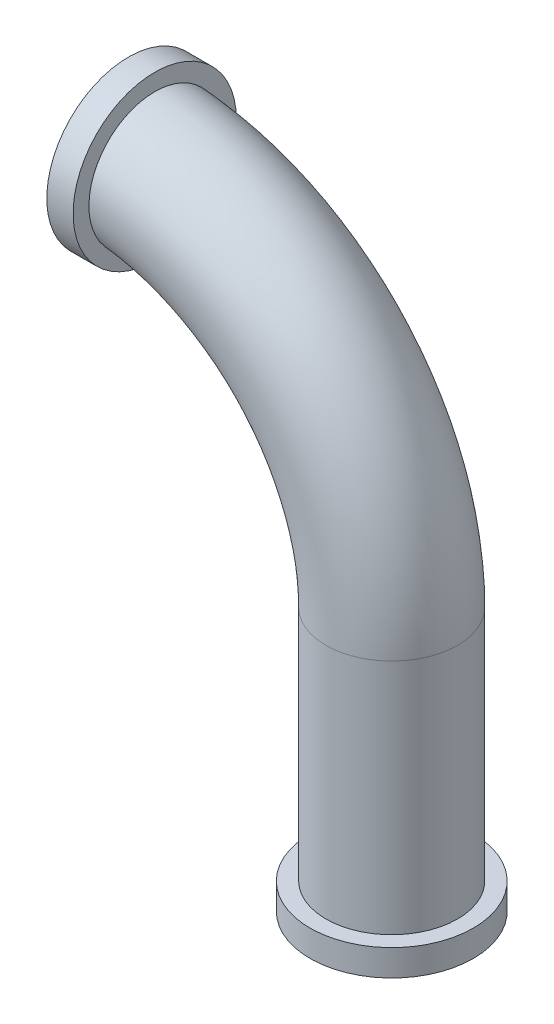
ISO-10303-21;
HEADER;
FILE_DESCRIPTION(('STEP AP214'),'2;1');
FILE_NAME('part.step','',(''),(''),'','','');
FILE_SCHEMA(('AUTOMOTIVE_DESIGN { 1 0 10303 214 1 1 1 1 }'));
ENDSEC;
DATA;
#1=APPLICATION_CONTEXT('core data for automotive mechanical design processes');
#2=APPLICATION_PROTOCOL_DEFINITION('international standard','automotive_design',2000,#1);
#3=PRODUCT_CONTEXT('',#1,'mechanical');
#4=PRODUCT('Part','Part','',(#3));
#5=PRODUCT_RELATED_PRODUCT_CATEGORY('part','',(#4));
#6=PRODUCT_DEFINITION_FORMATION('','',#4);
#7=PRODUCT_DEFINITION_CONTEXT('part definition',#1,'design');
#8=PRODUCT_DEFINITION('design','',#6,#7);
#9=PRODUCT_DEFINITION_SHAPE('','',#8);
#10=(LENGTH_UNIT() NAMED_UNIT(*) SI_UNIT(.MILLI.,.METRE.));
#11=(NAMED_UNIT(*) PLANE_ANGLE_UNIT() SI_UNIT($,.RADIAN.));
#12=(NAMED_UNIT(*) SI_UNIT($,.STERADIAN.) SOLID_ANGLE_UNIT());
#13=UNCERTAINTY_MEASURE_WITH_UNIT(LENGTH_MEASURE(1.E-05),#10,'distance_accuracy_value','');
#14=(GEOMETRIC_REPRESENTATION_CONTEXT(3) GLOBAL_UNCERTAINTY_ASSIGNED_CONTEXT((#13)) GLOBAL_UNIT_ASSIGNED_CONTEXT((#10,
#11,#12)) REPRESENTATION_CONTEXT('',''));
#15=CARTESIAN_POINT('',(0.,0.,0.));
#16=DIRECTION('',(0.,0.,1.));
#17=DIRECTION('',(1.,0.,0.));
#18=AXIS2_PLACEMENT_3D('',#15,#16,#17);
#19=CARTESIAN_POINT('',(1.,0.,0.));
#20=DIRECTION('',(0.,-1.,0.));
#21=DIRECTION('',(1.,0.,0.));
#22=AXIS2_PLACEMENT_3D('',#19,#20,#21);
#23=CYLINDRICAL_SURFACE('',#22,0.25);
#24=CARTESIAN_POINT('',(1.,0.,0.));
#25=DIRECTION('',(0.,-1.,0.));
#26=DIRECTION('',(1.,0.,0.));
#27=AXIS2_PLACEMENT_3D('',#24,#25,#26);
#28=CIRCLE('',#27,0.25);
#29=CARTESIAN_POINT('',(1.25,0.,0.));
#30=VERTEX_POINT('',#29);
#31=EDGE_CURVE('E10',#30,#30,#28,.T.);
#32=ORIENTED_EDGE('',*,*,#31,.T.);
#33=EDGE_LOOP('',(#32));
#34=FACE_BOUND('',#33,.T.);
#35=CARTESIAN_POINT('',(1.,-0.9,0.));
#36=DIRECTION('',(0.,-1.,0.));
#37=DIRECTION('',(1.,0.,0.));
#38=AXIS2_PLACEMENT_3D('',#35,#36,#37);
#39=CIRCLE('',#38,0.25);
#40=CARTESIAN_POINT('',(1.25,-0.9,0.));
#41=VERTEX_POINT('',#40);
#42=EDGE_CURVE('E36',#41,#41,#39,.F.);
#43=ORIENTED_EDGE('',*,*,#42,.T.);
#44=EDGE_LOOP('',(#43));
#45=FACE_BOUND('',#44,.T.);
#46=ADVANCED_FACE('F31',(#34,#45),#23,.T.);
#47=CARTESIAN_POINT('',(0.,0.,0.));
#48=DIRECTION('',(0.,0.,1.));
#49=DIRECTION('',(1.,0.,0.));
#50=AXIS2_PLACEMENT_3D('',#47,#48,#49);
#51=TOROIDAL_SURFACE('',#50,1.,0.25);
#52=CARTESIAN_POINT('',(0.1,0.798598903682393,-0.156239637939055));
#53=CARTESIAN_POINT('',(0.1,0.807484618255237,-0.167252077609579));
#54=CARTESIAN_POINT('',(0.1,0.817311544826019,-0.177518916216291));
#55=CARTESIAN_POINT('',(0.1,0.838559793603694,-0.196263733860563));
#56=CARTESIAN_POINT('',(0.1,0.849983168244315,-0.20473937428031));
#57=CARTESIAN_POINT('',(0.1,0.874081969106658,-0.219650591642891));
#58=CARTESIAN_POINT('',(0.1,0.886756519343003,-0.226087582802604));
#59=CARTESIAN_POINT('',(0.1,0.913000234487861,-0.236747922206686));
#60=CARTESIAN_POINT('',(0.1,0.926569163740226,-0.240971850957425));
#61=CARTESIAN_POINT('',(0.1,0.954266098089082,-0.247100376432861));
#62=CARTESIAN_POINT('',(0.1,0.96839572582249,-0.248997644239264));
#63=CARTESIAN_POINT('',(0.1,0.996773707944957,-0.25039290443244));
#64=CARTESIAN_POINT('',(0.1,1.01102206788375,-0.249890784032819));
#65=CARTESIAN_POINT('',(0.1,1.03922913334701,-0.246498215551317));
#66=CARTESIAN_POINT('',(0.1,1.0531878915475,-0.243608205779841));
#67=CARTESIAN_POINT('',(0.1,1.08041932555232,-0.235518387044002));
#68=CARTESIAN_POINT('',(0.1,1.09369201220857,-0.230318614626673));
#69=CARTESIAN_POINT('',(0.1,1.11913001861259,-0.217773097139499));
#70=CARTESIAN_POINT('',(0.1,1.13129864492456,-0.210434057268884));
#71=CARTESIAN_POINT('',(0.1,1.15422440361082,-0.19380938875738));
#72=CARTESIAN_POINT('',(0.1,1.16498156794405,-0.184523804203367));
#73=CARTESIAN_POINT('',(0.1,1.18473296660521,-0.164309957154077));
#74=CARTESIAN_POINT('',(0.1,1.19373414042714,-0.153388475286226));
#75=CARTESIAN_POINT('',(0.1,1.20976742880129,-0.130184858647995));
#76=CARTESIAN_POINT('',(0.1,1.2167995799634,-0.117902749181585));
#77=CARTESIAN_POINT('',(0.1,1.22866989147601,-0.0923732303855612));
#78=CARTESIAN_POINT('',(0.1,1.23351568693935,-0.0791293707956548));
#79=CARTESIAN_POINT('',(0.1,1.24090948117469,-0.0520150874536926));
#80=CARTESIAN_POINT('',(0.1,1.24345751315272,-0.0381446727593139));
#81=CARTESIAN_POINT('',(0.1,1.24617903253143,-0.0102038849674363));
#82=CARTESIAN_POINT('',(0.1,1.24635775803878,0.00386597816705056));
#83=CARTESIAN_POINT('',(0.1,1.2443490557881,0.0318357092211729));
#84=CARTESIAN_POINT('',(0.1,1.24216164206245,0.045735578148465));
#85=CARTESIAN_POINT('',(0.1,1.23548566564956,0.0729628531749483));
#86=CARTESIAN_POINT('',(0.1,1.23099839651049,0.0862905765141691));
#87=CARTESIAN_POINT('',(0.1,1.21985250641525,0.112004722408348));
#88=CARTESIAN_POINT('',(0.1,1.2131938798134,0.124391142515752));
#89=CARTESIAN_POINT('',(0.1,1.19788731542389,0.147887218294668));
#90=CARTESIAN_POINT('',(0.1,1.18923708938565,0.158995383124043));
#91=CARTESIAN_POINT('',(0.1,1.17019911655826,0.179606640126358));
#92=CARTESIAN_POINT('',(0.1,1.15981135014478,0.189109714168458));
#93=CARTESIAN_POINT('',(0.1,1.13756371948689,0.206269460174095));
#94=CARTESIAN_POINT('',(0.1,1.1256999380033,0.213921053042685));
#95=CARTESIAN_POINT('',(0.1,1.1008600065118,0.227132541762658));
#96=CARTESIAN_POINT('',(0.1,1.08788383586549,0.232692398795301));
#97=CARTESIAN_POINT('',(0.1,1.06113487356717,0.241585432017897));
#98=CARTESIAN_POINT('',(0.1,1.04735924079537,0.24491006219374));
#99=CARTESIAN_POINT('',(0.1,1.01944604647422,0.249209299271431));
#100=CARTESIAN_POINT('',(0.1,1.00530847649482,0.250183851386031));
#101=CARTESIAN_POINT('',(0.1,0.977013676572305,0.249758171980877));
#102=CARTESIAN_POINT('',(0.1,0.962856586441288,0.248348625861424));
#103=CARTESIAN_POINT('',(0.1,0.934978226305415,0.243178774257247));
#104=CARTESIAN_POINT('',(0.1,0.92125696445682,0.239418424805864));
#105=CARTESIAN_POINT('',(0.1,0.894606137350387,0.229641253917731));
#106=CARTESIAN_POINT('',(0.1,0.88167853001149,0.223619093935772));
#107=CARTESIAN_POINT('',(0.1,0.857019113242033,0.209487505095425));
#108=CARTESIAN_POINT('',(0.1,0.845287309521206,0.20137806627133));
#109=CARTESIAN_POINT('',(0.1,0.82337073898221,0.183309172670559));
#110=CARTESIAN_POINT('',(0.1,0.813184120587848,0.173351964393591));
#111=CARTESIAN_POINT('',(0.1,0.794638704052554,0.15185994909619));
#112=CARTESIAN_POINT('',(0.1,0.78627985742117,0.140325183941254));
#113=CARTESIAN_POINT('',(0.1,0.771681279589619,0.116074864617453));
#114=CARTESIAN_POINT('',(0.1,0.765429652543109,0.10336647310674));
#115=CARTESIAN_POINT('',(0.1,0.755168543349376,0.0770751991823277));
#116=CARTESIAN_POINT('',(0.1,0.751158856651886,0.0634923966743229));
#117=CARTESIAN_POINT('',(0.1,0.745526882823233,0.0359545442264934));
#118=CARTESIAN_POINT('',(0.1,0.743885669678653,0.0220033627581728));
#119=CARTESIAN_POINT('',(0.1,0.742980346928991,-0.00597955267888332));
#120=CARTESIAN_POINT('',(0.1,0.743716757423659,-0.0200113036018261));
#121=CARTESIAN_POINT('',(0.1,0.747536476925911,-0.047692442677422));
#122=CARTESIAN_POINT('',(0.1,0.750610365346218,-0.0613431382070541));
#123=CARTESIAN_POINT('',(0.1,0.7589995811081,-0.0879247327922062));
#124=CARTESIAN_POINT('',(0.1,0.764312213341437,-0.100856476238293));
#125=CARTESIAN_POINT('',(0.1,0.774564130392535,-0.120867695525504));
#126=CARTESIAN_POINT('',(0.1,0.778860177938197,-0.128284026486041));
#127=CARTESIAN_POINT('',(0.1,0.78818888620585,-0.142637803870627));
#128=CARTESIAN_POINT('',(0.1,0.793221545166894,-0.149575251439439));
#129=CARTESIAN_POINT('',(0.1,0.798598903682393,-0.156239637939055));
#130=B_SPLINE_CURVE_WITH_KNOTS('',3,(#52,#53,#54,#55,#56,#57,#58,#59,#60,#61,#62,#63,#64,#65,
#66,#67,#68,#69,#70,#71,#72,#73,#74,#75,#76,#77,#78,#79,#80,#81,#82,#83,#84,#85,#86,#87,#88,#89,
#90,#91,#92,#93,#94,#95,#96,#97,#98,#99,#100,#101,#102,#103,#104,#105,#106,#107,#108,#109,#110,
#111,#112,#113,#114,#115,#116,#117,#118,#119,#120,#121,#122,#123,#124,#125,#126,#127,#128,#129),
.UNSPECIFIED.,.T.,.F.,(4,2,2,2,2,2,2,2,2,2,2,2,2,2,2,2,2,2,2,2,2,2,2,2,2,2,2,2,2,2,2,2,2,2,2,2,
2,2,4),(0.,0.042419277218481,0.084893600183786,0.127338393721263,0.169772048022751,
0.21233902665477,0.254908006223219,0.297469173753552,0.340029667868765,0.382458171419216,
0.424885714119334,0.467142031024322,0.509397562208716,0.551504365817851,0.593610560912518,
0.635623651286504,0.677636492503144,0.719625729586843,0.76161507584624,0.803652908716628,
0.845691216407669,0.88784357092604,0.929996707675384,0.972310107021951,1.01462449280908,
1.05710458176961,1.09958546525149,1.14216725288102,1.18474924382094,1.22727979920904,
1.26980922613232,1.3120943759003,1.35437566702383,1.39631718923709,1.43826788668425,
1.48005040315259,1.52178276285504,1.54745365347394,1.57312448272488),.UNSPECIFIED.);
#131=CARTESIAN_POINT('',(0.1,0.798598903682393,-0.156239637939055));
#132=VERTEX_POINT('',#131);
#133=EDGE_CURVE('E48',#132,#132,#130,.T.);
#134=ORIENTED_EDGE('',*,*,#133,.T.);
#135=EDGE_LOOP('',(#134));
#136=FACE_BOUND('',#135,.T.);
#137=ORIENTED_EDGE('',*,*,#31,.F.);
#138=EDGE_LOOP('',(#137));
#139=FACE_BOUND('',#138,.T.);
#140=ADVANCED_FACE('F33',(#136,#139),#51,.T.);
#141=CARTESIAN_POINT('',(1.,-1.,0.));
#142=DIRECTION('',(0.,-1.,0.));
#143=DIRECTION('',(0.,0.,-1.));
#144=AXIS2_PLACEMENT_3D('',#141,#142,#143);
#145=PLANE('',#144);
#146=CARTESIAN_POINT('',(1.,-1.,0.));
#147=DIRECTION('',(0.,-1.,0.));
#148=DIRECTION('',(0.,0.,-1.));
#149=AXIS2_PLACEMENT_3D('',#146,#147,#148);
#150=CIRCLE('',#149,0.2);
#151=CARTESIAN_POINT('',(1.,-1.,-0.2));
#152=VERTEX_POINT('',#151);
#153=EDGE_CURVE('E40',#152,#152,#150,.T.);
#154=ORIENTED_EDGE('',*,*,#153,.F.);
#155=EDGE_LOOP('',(#154));
#156=FACE_BOUND('',#155,.T.);
#157=CARTESIAN_POINT('',(1.,-1.,0.));
#158=DIRECTION('',(0.,-1.,0.));
#159=DIRECTION('',(1.,0.,0.));
#160=AXIS2_PLACEMENT_3D('',#157,#158,#159);
#161=CIRCLE('',#160,0.31);
#162=CARTESIAN_POINT('',(1.31,-1.,0.));
#163=VERTEX_POINT('',#162);
#164=EDGE_CURVE('E96',#163,#163,#161,.T.);
#165=ORIENTED_EDGE('',*,*,#164,.T.);
#166=EDGE_LOOP('',(#165));
#167=FACE_BOUND('',#166,.T.);
#168=ADVANCED_FACE('F78',(#156,#167),#145,.T.);
#169=CARTESIAN_POINT('',(0.,1.,0.));
#170=DIRECTION('',(1.,0.,0.));
#171=DIRECTION('',(0.,0.,-1.));
#172=AXIS2_PLACEMENT_3D('',#169,#170,#171);
#173=PLANE('',#172);
#174=CARTESIAN_POINT('',(0.,1.,0.));
#175=DIRECTION('',(1.,0.,0.));
#176=DIRECTION('',(0.,0.,-1.));
#177=AXIS2_PLACEMENT_3D('',#174,#175,#176);
#178=CIRCLE('',#177,0.2);
#179=CARTESIAN_POINT('',(0.,1.2,0.));
#180=VERTEX_POINT('',#179);
#181=EDGE_CURVE('E53',#180,#180,#178,.T.);
#182=ORIENTED_EDGE('',*,*,#181,.T.);
#183=EDGE_LOOP('',(#182));
#184=FACE_BOUND('',#183,.T.);
#185=CARTESIAN_POINT('',(0.,1.,0.));
#186=DIRECTION('',(1.,0.,0.));
#187=DIRECTION('',(0.,0.,-1.));
#188=AXIS2_PLACEMENT_3D('',#185,#186,#187);
#189=CIRCLE('',#188,0.31);
#190=CARTESIAN_POINT('',(0.,1.,-0.31));
#191=VERTEX_POINT('',#190);
#192=EDGE_CURVE('E91',#191,#191,#189,.T.);
#193=ORIENTED_EDGE('',*,*,#192,.F.);
#194=EDGE_LOOP('',(#193));
#195=FACE_BOUND('',#194,.T.);
#196=ADVANCED_FACE('F74',(#184,#195),#173,.F.);
#197=CARTESIAN_POINT('',(1.,0.,0.));
#198=DIRECTION('',(0.,-1.,0.));
#199=DIRECTION('',(1.,0.,0.));
#200=AXIS2_PLACEMENT_3D('',#197,#198,#199);
#201=CYLINDRICAL_SURFACE('',#200,0.2);
#202=CARTESIAN_POINT('',(1.,0.,0.));
#203=DIRECTION('',(0.,-1.,0.));
#204=DIRECTION('',(0.,0.,-1.));
#205=AXIS2_PLACEMENT_3D('',#202,#203,#204);
#206=CIRCLE('',#205,0.2);
#207=CARTESIAN_POINT('',(1.2,0.,0.));
#208=VERTEX_POINT('',#207);
#209=EDGE_CURVE('E45',#208,#208,#206,.T.);
#210=ORIENTED_EDGE('',*,*,#209,.F.);
#211=EDGE_LOOP('',(#210));
#212=FACE_BOUND('',#211,.T.);
#213=ORIENTED_EDGE('',*,*,#153,.T.);
#214=EDGE_LOOP('',(#213));
#215=FACE_BOUND('',#214,.T.);
#216=ADVANCED_FACE('F70',(#212,#215),#201,.F.);
#217=CARTESIAN_POINT('',(0.,0.,0.));
#218=DIRECTION('',(0.,0.,1.));
#219=DIRECTION('',(1.,0.,0.));
#220=AXIS2_PLACEMENT_3D('',#217,#218,#219);
#221=TOROIDAL_SURFACE('',#220,1.,0.2);
#222=CARTESIAN_POINT('',(0.,0.,0.));
#223=DIRECTION('',(0.,0.,1.));
#224=DIRECTION('',(1.,0.,0.));
#225=AXIS2_PLACEMENT_3D('',#222,#223,#224);
#226=CIRCLE('',#225,1.2);
#227=EDGE_CURVE('',#208,#180,#226,.T.);
#228=ORIENTED_EDGE('',*,*,#209,.T.);
#229=ORIENTED_EDGE('',*,*,#181,.F.);
#230=ORIENTED_EDGE('',*,*,#227,.T.);
#231=ORIENTED_EDGE('',*,*,#227,.F.);
#232=EDGE_LOOP('',(#228,#230,#229,#231));
#233=FACE_BOUND('',#232,.T.);
#234=ADVANCED_FACE('F61',(#233),#221,.F.);
#235=CARTESIAN_POINT('',(0.1,1.,0.));
#236=DIRECTION('',(1.,0.,0.));
#237=DIRECTION('',(0.,0.,-1.));
#238=AXIS2_PLACEMENT_3D('',#235,#236,#237);
#239=PLANE('',#238);
#240=CARTESIAN_POINT('',(0.1,1.,0.));
#241=DIRECTION('',(1.,0.,0.));
#242=DIRECTION('',(0.,0.,-1.));
#243=AXIS2_PLACEMENT_3D('',#240,#241,#242);
#244=CIRCLE('',#243,0.31);
#245=CARTESIAN_POINT('',(0.1,1.,-0.31));
#246=VERTEX_POINT('',#245);
#247=EDGE_CURVE('E54',#246,#246,#244,.T.);
#248=ORIENTED_EDGE('',*,*,#247,.T.);
#249=EDGE_LOOP('',(#248));
#250=FACE_BOUND('',#249,.T.);
#251=ORIENTED_EDGE('',*,*,#133,.F.);
#252=EDGE_LOOP('',(#251));
#253=FACE_BOUND('',#252,.T.);
#254=ADVANCED_FACE('F55',(#250,#253),#239,.T.);
#255=CARTESIAN_POINT('',(0.1,1.,0.));
#256=DIRECTION('',(-1.,0.,0.));
#257=DIRECTION('',(0.,0.,1.));
#258=AXIS2_PLACEMENT_3D('',#255,#256,#257);
#259=CYLINDRICAL_SURFACE('',#258,0.31);
#260=ORIENTED_EDGE('',*,*,#247,.F.);
#261=EDGE_LOOP('',(#260));
#262=FACE_BOUND('',#261,.T.);
#263=ORIENTED_EDGE('',*,*,#192,.T.);
#264=EDGE_LOOP('',(#263));
#265=FACE_BOUND('',#264,.T.);
#266=ADVANCED_FACE('F60',(#262,#265),#259,.T.);
#267=CARTESIAN_POINT('',(1.,-0.9,0.));
#268=DIRECTION('',(0.,-1.,0.));
#269=DIRECTION('',(0.,0.,-1.));
#270=AXIS2_PLACEMENT_3D('',#267,#268,#269);
#271=CYLINDRICAL_SURFACE('',#270,0.31);
#272=CARTESIAN_POINT('',(1.,-0.9,0.));
#273=DIRECTION('',(0.,-1.,0.));
#274=DIRECTION('',(1.,0.,0.));
#275=AXIS2_PLACEMENT_3D('',#272,#273,#274);
#276=CIRCLE('',#275,0.31);
#277=CARTESIAN_POINT('',(1.31,-0.9,0.));
#278=VERTEX_POINT('',#277);
#279=EDGE_CURVE('E92',#278,#278,#276,.T.);
#280=ORIENTED_EDGE('',*,*,#279,.T.);
#281=EDGE_LOOP('',(#280));
#282=FACE_BOUND('',#281,.T.);
#283=ORIENTED_EDGE('',*,*,#164,.F.);
#284=EDGE_LOOP('',(#283));
#285=FACE_BOUND('',#284,.T.);
#286=ADVANCED_FACE('F63',(#282,#285),#271,.T.);
#287=CARTESIAN_POINT('',(1.,-0.9,0.));
#288=DIRECTION('',(0.,-1.,0.));
#289=DIRECTION('',(1.,0.,0.));
#290=AXIS2_PLACEMENT_3D('',#287,#288,#289);
#291=PLANE('',#290);
#292=ORIENTED_EDGE('',*,*,#42,.F.);
#293=EDGE_LOOP('',(#292));
#294=FACE_BOUND('',#293,.T.);
#295=ORIENTED_EDGE('',*,*,#279,.F.);
#296=EDGE_LOOP('',(#295));
#297=FACE_BOUND('',#296,.T.);
#298=ADVANCED_FACE('F115',(#294,#297),#291,.F.);
#299=CLOSED_SHELL('',(#46,#140,#168,#196,#216,#234,#254,#266,#286,#298));
#300=MANIFOLD_SOLID_BREP('B2',#299);
#301=ADVANCED_BREP_SHAPE_REPRESENTATION('',(#18,#300),#14);
#302=SHAPE_DEFINITION_REPRESENTATION(#9,#301);
ENDSEC;
END-ISO-10303-21;
